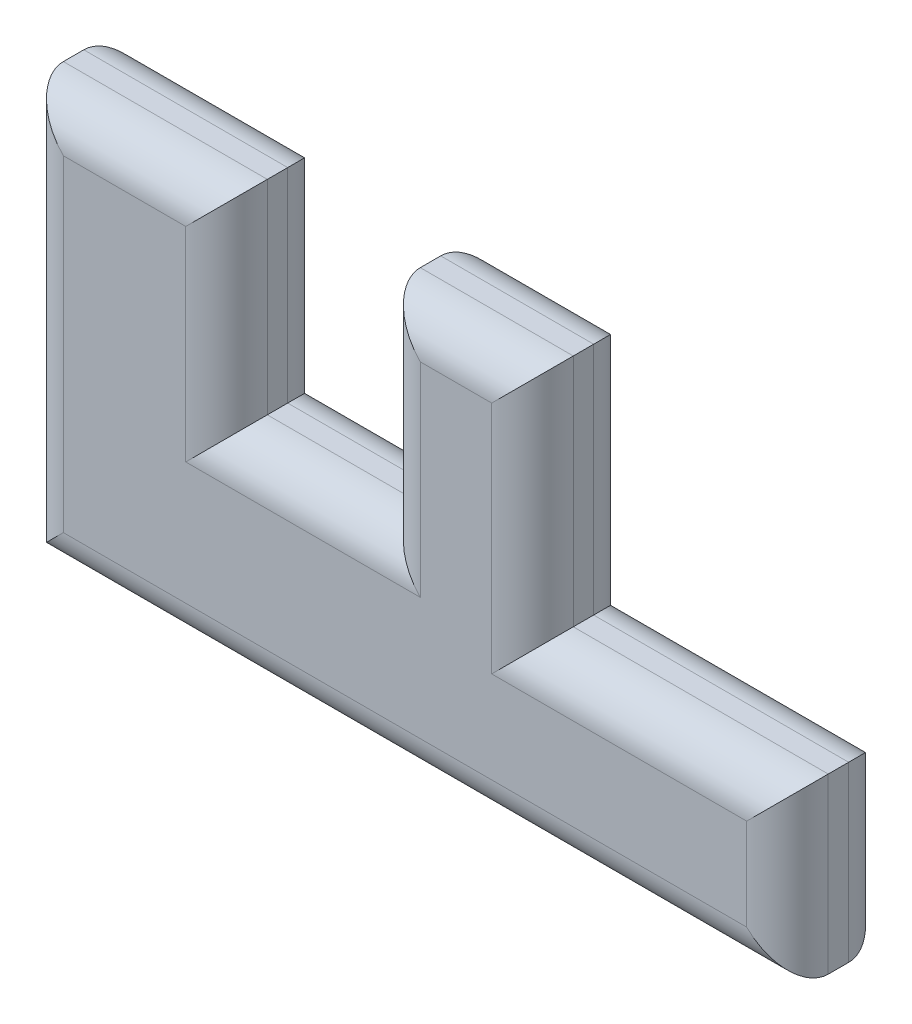
ISO-10303-21;
HEADER;
FILE_DESCRIPTION(('STEP AP214'),'2;1');
FILE_NAME('part.step','',(''),(''),'','','');
FILE_SCHEMA(('AUTOMOTIVE_DESIGN { 1 0 10303 214 1 1 1 1 }'));
ENDSEC;
DATA;
#1=APPLICATION_CONTEXT('core data for automotive mechanical design processes');
#2=APPLICATION_PROTOCOL_DEFINITION('international standard','automotive_design',2000,#1);
#3=PRODUCT_CONTEXT('',#1,'mechanical');
#4=PRODUCT('Part','Part','',(#3));
#5=PRODUCT_RELATED_PRODUCT_CATEGORY('part','',(#4));
#6=PRODUCT_DEFINITION_FORMATION('','',#4);
#7=PRODUCT_DEFINITION_CONTEXT('part definition',#1,'design');
#8=PRODUCT_DEFINITION('design','',#6,#7);
#9=PRODUCT_DEFINITION_SHAPE('','',#8);
#10=(LENGTH_UNIT() NAMED_UNIT(*) SI_UNIT(.MILLI.,.METRE.));
#11=(NAMED_UNIT(*) PLANE_ANGLE_UNIT() SI_UNIT($,.RADIAN.));
#12=(NAMED_UNIT(*) SI_UNIT($,.STERADIAN.) SOLID_ANGLE_UNIT());
#13=UNCERTAINTY_MEASURE_WITH_UNIT(LENGTH_MEASURE(1.E-05),#10,'distance_accuracy_value','');
#14=(GEOMETRIC_REPRESENTATION_CONTEXT(3) GLOBAL_UNCERTAINTY_ASSIGNED_CONTEXT((#13)) GLOBAL_UNIT_ASSIGNED_CONTEXT((#10,
#11,#12)) REPRESENTATION_CONTEXT('',''));
#15=CARTESIAN_POINT('',(0.,0.,0.));
#16=DIRECTION('',(0.,0.,1.));
#17=DIRECTION('',(1.,0.,0.));
#18=AXIS2_PLACEMENT_3D('',#15,#16,#17);
#19=CARTESIAN_POINT('',(95.25,0.,12.7));
#20=DIRECTION('',(0.,1.,0.));
#21=DIRECTION('',(0.,0.,1.));
#22=AXIS2_PLACEMENT_3D('',#19,#20,#21);
#23=PLANE('',#22);
#24=DIRECTION('',(0.,0.,-1.));
#25=VECTOR('',#24,1.);
#26=CARTESIAN_POINT('',(0.,0.,12.7));
#27=LINE('',#26,#25);
#28=CARTESIAN_POINT('',(0.,0.,7.62));
#29=VERTEX_POINT('',#28);
#30=CARTESIAN_POINT('',(0.,0.,5.08));
#31=VERTEX_POINT('',#30);
#32=EDGE_CURVE('E376',#29,#31,#27,.T.);
#33=ORIENTED_EDGE('',*,*,#32,.T.);
#34=DIRECTION('',(1.,0.,0.));
#35=VECTOR('',#34,1.);
#36=CARTESIAN_POINT('',(95.25,0.,5.08));
#37=LINE('',#36,#35);
#38=CARTESIAN_POINT('',(95.25,0.,5.08));
#39=VERTEX_POINT('',#38);
#40=EDGE_CURVE('E311',#31,#39,#37,.T.);
#41=ORIENTED_EDGE('',*,*,#40,.T.);
#42=DIRECTION('',(0.,0.,-1.));
#43=VECTOR('',#42,1.);
#44=CARTESIAN_POINT('',(95.25,0.,12.7));
#45=LINE('',#44,#43);
#46=CARTESIAN_POINT('',(95.25,0.,7.62));
#47=VERTEX_POINT('',#46);
#48=EDGE_CURVE('E208',#47,#39,#45,.T.);
#49=ORIENTED_EDGE('',*,*,#48,.F.);
#50=DIRECTION('',(1.,0.,0.));
#51=VECTOR('',#50,1.);
#52=CARTESIAN_POINT('',(95.25,0.,7.62));
#53=LINE('',#52,#51);
#54=EDGE_CURVE('E308',#47,#29,#53,.F.);
#55=ORIENTED_EDGE('',*,*,#54,.T.);
#56=EDGE_LOOP('',(#33,#41,#49,#55));
#57=FACE_BOUND('',#56,.T.);
#58=ADVANCED_FACE('F45',(#57),#23,.F.);
#59=CARTESIAN_POINT('',(95.25,21.59,12.7));
#60=DIRECTION('',(-1.,0.,0.));
#61=DIRECTION('',(0.,0.,1.));
#62=AXIS2_PLACEMENT_3D('',#59,#60,#61);
#63=PLANE('',#62);
#64=ORIENTED_EDGE('',*,*,#48,.T.);
#65=DIRECTION('',(0.,1.,0.));
#66=VECTOR('',#65,1.);
#67=CARTESIAN_POINT('',(95.25,21.59,5.08));
#68=LINE('',#67,#66);
#69=CARTESIAN_POINT('',(95.25,21.59,5.08));
#70=VERTEX_POINT('',#69);
#71=EDGE_CURVE('E206',#39,#70,#68,.T.);
#72=ORIENTED_EDGE('',*,*,#71,.T.);
#73=DIRECTION('',(0.,0.,-1.));
#74=VECTOR('',#73,1.);
#75=CARTESIAN_POINT('',(95.25,21.59,12.7));
#76=LINE('',#75,#74);
#77=CARTESIAN_POINT('',(95.25,21.59,7.62));
#78=VERTEX_POINT('',#77);
#79=EDGE_CURVE('E187',#78,#70,#76,.T.);
#80=ORIENTED_EDGE('',*,*,#79,.F.);
#81=DIRECTION('',(0.,1.,0.));
#82=VECTOR('',#81,1.);
#83=CARTESIAN_POINT('',(95.25,21.59,7.62));
#84=LINE('',#83,#82);
#85=EDGE_CURVE('E203',#78,#47,#84,.F.);
#86=ORIENTED_EDGE('',*,*,#85,.T.);
#87=EDGE_LOOP('',(#64,#72,#80,#86));
#88=FACE_BOUND('',#87,.T.);
#89=ADVANCED_FACE('F201',(#88),#63,.F.);
#90=CARTESIAN_POINT('',(63.5,21.59,12.7));
#91=DIRECTION('',(0.,-1.,0.));
#92=DIRECTION('',(0.,0.,-1.));
#93=AXIS2_PLACEMENT_3D('',#90,#91,#92);
#94=PLANE('',#93);
#95=ORIENTED_EDGE('',*,*,#79,.T.);
#96=DIRECTION('',(-1.,0.,0.));
#97=VECTOR('',#96,1.);
#98=CARTESIAN_POINT('',(63.5,21.59,5.08));
#99=LINE('',#98,#97);
#100=CARTESIAN_POINT('',(63.5,21.59,5.08));
#101=VERTEX_POINT('',#100);
#102=EDGE_CURVE('E195',#70,#101,#99,.T.);
#103=ORIENTED_EDGE('',*,*,#102,.T.);
#104=DIRECTION('',(0.,0.,-1.));
#105=VECTOR('',#104,1.);
#106=CARTESIAN_POINT('',(63.5,21.59,12.7));
#107=LINE('',#106,#105);
#108=CARTESIAN_POINT('',(63.5,21.59,7.62));
#109=VERTEX_POINT('',#108);
#110=EDGE_CURVE('E189',#109,#101,#107,.T.);
#111=ORIENTED_EDGE('',*,*,#110,.F.);
#112=DIRECTION('',(-1.,0.,0.));
#113=VECTOR('',#112,1.);
#114=CARTESIAN_POINT('',(63.5,21.59,7.62));
#115=LINE('',#114,#113);
#116=EDGE_CURVE('E184',#109,#78,#115,.F.);
#117=ORIENTED_EDGE('',*,*,#116,.T.);
#118=EDGE_LOOP('',(#95,#103,#111,#117));
#119=FACE_BOUND('',#118,.T.);
#120=ADVANCED_FACE('F186',(#119),#94,.F.);
#121=CARTESIAN_POINT('',(63.5,50.8,12.7));
#122=DIRECTION('',(-1.,0.,0.));
#123=DIRECTION('',(0.,0.,1.));
#124=AXIS2_PLACEMENT_3D('',#121,#122,#123);
#125=PLANE('',#124);
#126=ORIENTED_EDGE('',*,*,#110,.T.);
#127=DIRECTION('',(0.,1.,0.));
#128=VECTOR('',#127,1.);
#129=CARTESIAN_POINT('',(63.5,50.8,5.08));
#130=LINE('',#129,#128);
#131=CARTESIAN_POINT('',(63.5,50.8,5.08));
#132=VERTEX_POINT('',#131);
#133=EDGE_CURVE('E268',#101,#132,#130,.T.);
#134=ORIENTED_EDGE('',*,*,#133,.T.);
#135=DIRECTION('',(0.,0.,-1.));
#136=VECTOR('',#135,1.);
#137=CARTESIAN_POINT('',(63.5,50.8,12.7));
#138=LINE('',#137,#136);
#139=CARTESIAN_POINT('',(63.5,50.8,7.62));
#140=VERTEX_POINT('',#139);
#141=EDGE_CURVE('E420',#140,#132,#138,.T.);
#142=ORIENTED_EDGE('',*,*,#141,.F.);
#143=DIRECTION('',(0.,1.,0.));
#144=VECTOR('',#143,1.);
#145=CARTESIAN_POINT('',(63.5,50.8,7.62));
#146=LINE('',#145,#144);
#147=EDGE_CURVE('E265',#140,#109,#146,.F.);
#148=ORIENTED_EDGE('',*,*,#147,.T.);
#149=EDGE_LOOP('',(#126,#134,#142,#148));
#150=FACE_BOUND('',#149,.T.);
#151=ADVANCED_FACE('F425',(#150),#125,.F.);
#152=CARTESIAN_POINT('',(44.45,50.8,12.7));
#153=DIRECTION('',(0.,-1.,0.));
#154=DIRECTION('',(0.,0.,-1.));
#155=AXIS2_PLACEMENT_3D('',#152,#153,#154);
#156=PLANE('',#155);
#157=ORIENTED_EDGE('',*,*,#141,.T.);
#158=DIRECTION('',(-1.,0.,0.));
#159=VECTOR('',#158,1.);
#160=CARTESIAN_POINT('',(44.45,50.8,5.08));
#161=LINE('',#160,#159);
#162=CARTESIAN_POINT('',(44.45,50.8,5.08));
#163=VERTEX_POINT('',#162);
#164=EDGE_CURVE('E274',#132,#163,#161,.T.);
#165=ORIENTED_EDGE('',*,*,#164,.T.);
#166=DIRECTION('',(0.,0.,-1.));
#167=VECTOR('',#166,1.);
#168=CARTESIAN_POINT('',(44.45,50.8,12.7));
#169=LINE('',#168,#167);
#170=CARTESIAN_POINT('',(44.45,50.8,7.62));
#171=VERTEX_POINT('',#170);
#172=EDGE_CURVE('E423',#171,#163,#169,.T.);
#173=ORIENTED_EDGE('',*,*,#172,.F.);
#174=DIRECTION('',(-1.,0.,0.));
#175=VECTOR('',#174,1.);
#176=CARTESIAN_POINT('',(44.45,50.8,7.62));
#177=LINE('',#176,#175);
#178=EDGE_CURVE('E271',#171,#140,#177,.F.);
#179=ORIENTED_EDGE('',*,*,#178,.T.);
#180=EDGE_LOOP('',(#157,#165,#173,#179));
#181=FACE_BOUND('',#180,.T.);
#182=ADVANCED_FACE('F419',(#181),#156,.F.);
#183=CARTESIAN_POINT('',(44.45,25.4,12.7));
#184=DIRECTION('',(1.,0.,0.));
#185=DIRECTION('',(0.,0.,-1.));
#186=AXIS2_PLACEMENT_3D('',#183,#184,#185);
#187=PLANE('',#186);
#188=ORIENTED_EDGE('',*,*,#172,.T.);
#189=DIRECTION('',(0.,-1.,0.));
#190=VECTOR('',#189,1.);
#191=CARTESIAN_POINT('',(44.45,25.4,5.08));
#192=LINE('',#191,#190);
#193=CARTESIAN_POINT('',(44.45,25.4,5.08));
#194=VERTEX_POINT('',#193);
#195=EDGE_CURVE('E280',#163,#194,#192,.T.);
#196=ORIENTED_EDGE('',*,*,#195,.T.);
#197=DIRECTION('',(0.,0.,-1.));
#198=VECTOR('',#197,1.);
#199=CARTESIAN_POINT('',(44.45,25.4,12.7));
#200=LINE('',#199,#198);
#201=CARTESIAN_POINT('',(44.45,25.4,7.62));
#202=VERTEX_POINT('',#201);
#203=EDGE_CURVE('E432',#202,#194,#200,.T.);
#204=ORIENTED_EDGE('',*,*,#203,.F.);
#205=DIRECTION('',(0.,-1.,0.));
#206=VECTOR('',#205,1.);
#207=CARTESIAN_POINT('',(44.45,25.4,7.62));
#208=LINE('',#207,#206);
#209=EDGE_CURVE('E277',#202,#171,#208,.F.);
#210=ORIENTED_EDGE('',*,*,#209,.T.);
#211=EDGE_LOOP('',(#188,#196,#204,#210));
#212=FACE_BOUND('',#211,.T.);
#213=ADVANCED_FACE('F485',(#212),#187,.F.);
#214=CARTESIAN_POINT('',(25.4,25.4,12.7));
#215=DIRECTION('',(0.,-1.,0.));
#216=DIRECTION('',(0.,0.,-1.));
#217=AXIS2_PLACEMENT_3D('',#214,#215,#216);
#218=PLANE('',#217);
#219=ORIENTED_EDGE('',*,*,#203,.T.);
#220=DIRECTION('',(-1.,0.,0.));
#221=VECTOR('',#220,1.);
#222=CARTESIAN_POINT('',(25.4,25.4,5.08));
#223=LINE('',#222,#221);
#224=CARTESIAN_POINT('',(25.4,25.4,5.08));
#225=VERTEX_POINT('',#224);
#226=EDGE_CURVE('E286',#194,#225,#223,.T.);
#227=ORIENTED_EDGE('',*,*,#226,.T.);
#228=DIRECTION('',(0.,0.,-1.));
#229=VECTOR('',#228,1.);
#230=CARTESIAN_POINT('',(25.4,25.4,12.7));
#231=LINE('',#230,#229);
#232=CARTESIAN_POINT('',(25.4,25.4,7.62));
#233=VERTEX_POINT('',#232);
#234=EDGE_CURVE('E438',#233,#225,#231,.T.);
#235=ORIENTED_EDGE('',*,*,#234,.F.);
#236=DIRECTION('',(-1.,0.,0.));
#237=VECTOR('',#236,1.);
#238=CARTESIAN_POINT('',(25.4,25.4,7.62));
#239=LINE('',#238,#237);
#240=EDGE_CURVE('E283',#233,#202,#239,.F.);
#241=ORIENTED_EDGE('',*,*,#240,.T.);
#242=EDGE_LOOP('',(#219,#227,#235,#241));
#243=FACE_BOUND('',#242,.T.);
#244=ADVANCED_FACE('F499',(#243),#218,.F.);
#245=CARTESIAN_POINT('',(25.4,50.8,12.7));
#246=DIRECTION('',(-1.,0.,0.));
#247=DIRECTION('',(0.,-1.,0.));
#248=AXIS2_PLACEMENT_3D('',#245,#246,#247);
#249=PLANE('',#248);
#250=ORIENTED_EDGE('',*,*,#234,.T.);
#251=DIRECTION('',(0.,1.,0.));
#252=VECTOR('',#251,1.);
#253=CARTESIAN_POINT('',(25.4,50.8,5.08));
#254=LINE('',#253,#252);
#255=CARTESIAN_POINT('',(25.4,50.8,5.08));
#256=VERTEX_POINT('',#255);
#257=EDGE_CURVE('E292',#225,#256,#254,.T.);
#258=ORIENTED_EDGE('',*,*,#257,.T.);
#259=DIRECTION('',(0.,0.,-1.));
#260=VECTOR('',#259,1.);
#261=CARTESIAN_POINT('',(25.4,50.8,12.7));
#262=LINE('',#261,#260);
#263=CARTESIAN_POINT('',(25.4,50.8,7.62));
#264=VERTEX_POINT('',#263);
#265=EDGE_CURVE('E442',#264,#256,#262,.T.);
#266=ORIENTED_EDGE('',*,*,#265,.F.);
#267=DIRECTION('',(0.,1.,0.));
#268=VECTOR('',#267,1.);
#269=CARTESIAN_POINT('',(25.4,50.8,7.62));
#270=LINE('',#269,#268);
#271=EDGE_CURVE('E289',#264,#233,#270,.F.);
#272=ORIENTED_EDGE('',*,*,#271,.T.);
#273=EDGE_LOOP('',(#250,#258,#266,#272));
#274=FACE_BOUND('',#273,.T.);
#275=ADVANCED_FACE('F502',(#274),#249,.F.);
#276=CARTESIAN_POINT('',(0.,50.8,12.7));
#277=DIRECTION('',(0.,-1.,0.));
#278=DIRECTION('',(0.,0.,-1.));
#279=AXIS2_PLACEMENT_3D('',#276,#277,#278);
#280=PLANE('',#279);
#281=ORIENTED_EDGE('',*,*,#265,.T.);
#282=DIRECTION('',(-1.,0.,0.));
#283=VECTOR('',#282,1.);
#284=CARTESIAN_POINT('',(0.,50.8,5.08));
#285=LINE('',#284,#283);
#286=CARTESIAN_POINT('',(0.,50.8,5.08));
#287=VERTEX_POINT('',#286);
#288=EDGE_CURVE('E298',#256,#287,#285,.T.);
#289=ORIENTED_EDGE('',*,*,#288,.T.);
#290=DIRECTION('',(0.,0.,-1.));
#291=VECTOR('',#290,1.);
#292=CARTESIAN_POINT('',(0.,50.8,12.7));
#293=LINE('',#292,#291);
#294=CARTESIAN_POINT('',(0.,50.8,7.62));
#295=VERTEX_POINT('',#294);
#296=EDGE_CURVE('E446',#295,#287,#293,.T.);
#297=ORIENTED_EDGE('',*,*,#296,.F.);
#298=DIRECTION('',(-1.,0.,0.));
#299=VECTOR('',#298,1.);
#300=CARTESIAN_POINT('',(0.,50.8,7.62));
#301=LINE('',#300,#299);
#302=EDGE_CURVE('E295',#295,#264,#301,.F.);
#303=ORIENTED_EDGE('',*,*,#302,.T.);
#304=EDGE_LOOP('',(#281,#289,#297,#303));
#305=FACE_BOUND('',#304,.T.);
#306=ADVANCED_FACE('F572',(#305),#280,.F.);
#307=CARTESIAN_POINT('',(0.,0.,12.7));
#308=DIRECTION('',(1.,0.,0.));
#309=DIRECTION('',(0.,0.,-1.));
#310=AXIS2_PLACEMENT_3D('',#307,#308,#309);
#311=PLANE('',#310);
#312=ORIENTED_EDGE('',*,*,#296,.T.);
#313=DIRECTION('',(0.,-1.,0.));
#314=VECTOR('',#313,1.);
#315=CARTESIAN_POINT('',(0.,0.,5.08));
#316=LINE('',#315,#314);
#317=EDGE_CURVE('E305',#287,#31,#316,.T.);
#318=ORIENTED_EDGE('',*,*,#317,.T.);
#319=ORIENTED_EDGE('',*,*,#32,.F.);
#320=DIRECTION('',(0.,-1.,0.));
#321=VECTOR('',#320,1.);
#322=CARTESIAN_POINT('',(0.,0.,7.62));
#323=LINE('',#322,#321);
#324=EDGE_CURVE('E301',#29,#295,#323,.F.);
#325=ORIENTED_EDGE('',*,*,#324,.T.);
#326=EDGE_LOOP('',(#312,#318,#319,#325));
#327=FACE_BOUND('',#326,.T.);
#328=ADVANCED_FACE('F567',(#327),#311,.F.);
#329=CARTESIAN_POINT('',(0.,0.,12.7));
#330=DIRECTION('',(0.,0.,-1.));
#331=DIRECTION('',(-1.,0.,0.));
#332=AXIS2_PLACEMENT_3D('',#329,#330,#331);
#333=PLANE('',#332);
#334=DIRECTION('',(-1.,0.,0.));
#335=VECTOR('',#334,1.);
#336=CARTESIAN_POINT('',(0.,45.72,12.7));
#337=LINE('',#336,#335);
#338=CARTESIAN_POINT('',(20.32,45.72,12.7));
#339=VERTEX_POINT('',#338);
#340=CARTESIAN_POINT('',(5.08,45.72,12.7));
#341=VERTEX_POINT('',#340);
#342=EDGE_CURVE('E55',#339,#341,#337,.T.);
#343=ORIENTED_EDGE('',*,*,#342,.T.);
#344=DIRECTION('',(0.,-1.,0.));
#345=VECTOR('',#344,1.);
#346=CARTESIAN_POINT('',(5.08,0.,12.7));
#347=LINE('',#346,#345);
#348=CARTESIAN_POINT('',(5.08,5.08,12.7));
#349=VERTEX_POINT('',#348);
#350=EDGE_CURVE('E11',#341,#349,#347,.T.);
#351=ORIENTED_EDGE('',*,*,#350,.T.);
#352=DIRECTION('',(1.,0.,0.));
#353=VECTOR('',#352,1.);
#354=CARTESIAN_POINT('',(0.,5.08,12.7));
#355=LINE('',#354,#353);
#356=CARTESIAN_POINT('',(90.17,5.08,12.7));
#357=VERTEX_POINT('',#356);
#358=EDGE_CURVE('E314',#349,#357,#355,.T.);
#359=ORIENTED_EDGE('',*,*,#358,.T.);
#360=DIRECTION('',(0.,1.,0.));
#361=VECTOR('',#360,1.);
#362=CARTESIAN_POINT('',(90.17,0.,12.7));
#363=LINE('',#362,#361);
#364=CARTESIAN_POINT('',(90.17,16.51,12.7));
#365=VERTEX_POINT('',#364);
#366=EDGE_CURVE('E317',#357,#365,#363,.T.);
#367=ORIENTED_EDGE('',*,*,#366,.T.);
#368=DIRECTION('',(-1.,0.,0.));
#369=VECTOR('',#368,1.);
#370=CARTESIAN_POINT('',(0.,16.51,12.7));
#371=LINE('',#370,#369);
#372=CARTESIAN_POINT('',(58.42,16.51,12.7));
#373=VERTEX_POINT('',#372);
#374=EDGE_CURVE('E214',#365,#373,#371,.T.);
#375=ORIENTED_EDGE('',*,*,#374,.T.);
#376=DIRECTION('',(0.,1.,0.));
#377=VECTOR('',#376,1.);
#378=CARTESIAN_POINT('',(58.42,0.,12.7));
#379=LINE('',#378,#377);
#380=CARTESIAN_POINT('',(58.42,45.72,12.7));
#381=VERTEX_POINT('',#380);
#382=EDGE_CURVE('E322',#373,#381,#379,.T.);
#383=ORIENTED_EDGE('',*,*,#382,.T.);
#384=DIRECTION('',(-1.,0.,0.));
#385=VECTOR('',#384,1.);
#386=CARTESIAN_POINT('',(0.,45.72,12.7));
#387=LINE('',#386,#385);
#388=CARTESIAN_POINT('',(49.53,45.72,12.7));
#389=VERTEX_POINT('',#388);
#390=EDGE_CURVE('E325',#381,#389,#387,.T.);
#391=ORIENTED_EDGE('',*,*,#390,.T.);
#392=DIRECTION('',(0.,-1.,0.));
#393=VECTOR('',#392,1.);
#394=CARTESIAN_POINT('',(49.53,0.,12.7));
#395=LINE('',#394,#393);
#396=CARTESIAN_POINT('',(49.53,20.32,12.7));
#397=VERTEX_POINT('',#396);
#398=EDGE_CURVE('E328',#389,#397,#395,.T.);
#399=ORIENTED_EDGE('',*,*,#398,.T.);
#400=DIRECTION('',(-1.,0.,0.));
#401=VECTOR('',#400,1.);
#402=CARTESIAN_POINT('',(0.,20.32,12.7));
#403=LINE('',#402,#401);
#404=CARTESIAN_POINT('',(20.32,20.32,12.7));
#405=VERTEX_POINT('',#404);
#406=EDGE_CURVE('E331',#397,#405,#403,.T.);
#407=ORIENTED_EDGE('',*,*,#406,.T.);
#408=DIRECTION('',(0.,1.,0.));
#409=VECTOR('',#408,1.);
#410=CARTESIAN_POINT('',(20.32,0.,12.7));
#411=LINE('',#410,#409);
#412=EDGE_CURVE('E66',#405,#339,#411,.T.);
#413=ORIENTED_EDGE('',*,*,#412,.T.);
#414=EDGE_LOOP('',(#343,#351,#359,#367,#375,#383,#391,#399,#407,#413));
#415=FACE_BOUND('',#414,.T.);
#416=ADVANCED_FACE('F516',(#415),#333,.F.);
#417=CARTESIAN_POINT('',(0.,0.,0.));
#418=DIRECTION('',(0.,0.,-1.));
#419=DIRECTION('',(-1.,0.,0.));
#420=AXIS2_PLACEMENT_3D('',#417,#418,#419);
#421=PLANE('',#420);
#422=DIRECTION('',(-1.,0.,0.));
#423=VECTOR('',#422,1.);
#424=CARTESIAN_POINT('',(95.25,16.51,0.));
#425=LINE('',#424,#423);
#426=CARTESIAN_POINT('',(58.42,16.51,0.));
#427=VERTEX_POINT('',#426);
#428=CARTESIAN_POINT('',(90.17,16.51,0.));
#429=VERTEX_POINT('',#428);
#430=EDGE_CURVE('E257',#427,#429,#425,.F.);
#431=ORIENTED_EDGE('',*,*,#430,.T.);
#432=DIRECTION('',(0.,1.,0.));
#433=VECTOR('',#432,1.);
#434=CARTESIAN_POINT('',(90.17,0.,0.));
#435=LINE('',#434,#433);
#436=CARTESIAN_POINT('',(90.17,5.08,0.));
#437=VERTEX_POINT('',#436);
#438=EDGE_CURVE('E196',#429,#437,#435,.F.);
#439=ORIENTED_EDGE('',*,*,#438,.T.);
#440=DIRECTION('',(1.,0.,0.));
#441=VECTOR('',#440,1.);
#442=CARTESIAN_POINT('',(0.,5.08,0.));
#443=LINE('',#442,#441);
#444=CARTESIAN_POINT('',(5.08,5.08,0.));
#445=VERTEX_POINT('',#444);
#446=EDGE_CURVE('E230',#437,#445,#443,.F.);
#447=ORIENTED_EDGE('',*,*,#446,.T.);
#448=DIRECTION('',(0.,-1.,0.));
#449=VECTOR('',#448,1.);
#450=CARTESIAN_POINT('',(5.08,50.8,0.));
#451=LINE('',#450,#449);
#452=CARTESIAN_POINT('',(5.08,45.72,0.));
#453=VERTEX_POINT('',#452);
#454=EDGE_CURVE('E236',#445,#453,#451,.F.);
#455=ORIENTED_EDGE('',*,*,#454,.T.);
#456=DIRECTION('',(-1.,0.,0.));
#457=VECTOR('',#456,1.);
#458=CARTESIAN_POINT('',(25.4,45.72,0.));
#459=LINE('',#458,#457);
#460=CARTESIAN_POINT('',(20.32,45.72,0.));
#461=VERTEX_POINT('',#460);
#462=EDGE_CURVE('E239',#453,#461,#459,.F.);
#463=ORIENTED_EDGE('',*,*,#462,.T.);
#464=DIRECTION('',(0.,1.,0.));
#465=VECTOR('',#464,1.);
#466=CARTESIAN_POINT('',(20.32,25.4,0.));
#467=LINE('',#466,#465);
#468=CARTESIAN_POINT('',(20.32,20.32,0.));
#469=VERTEX_POINT('',#468);
#470=EDGE_CURVE('E242',#461,#469,#467,.F.);
#471=ORIENTED_EDGE('',*,*,#470,.T.);
#472=DIRECTION('',(-1.,0.,0.));
#473=VECTOR('',#472,1.);
#474=CARTESIAN_POINT('',(44.45,20.32,0.));
#475=LINE('',#474,#473);
#476=CARTESIAN_POINT('',(49.53,20.32,0.));
#477=VERTEX_POINT('',#476);
#478=EDGE_CURVE('E245',#469,#477,#475,.F.);
#479=ORIENTED_EDGE('',*,*,#478,.T.);
#480=DIRECTION('',(0.,-1.,0.));
#481=VECTOR('',#480,1.);
#482=CARTESIAN_POINT('',(49.53,50.8,0.));
#483=LINE('',#482,#481);
#484=CARTESIAN_POINT('',(49.53,45.72,0.));
#485=VERTEX_POINT('',#484);
#486=EDGE_CURVE('E248',#477,#485,#483,.F.);
#487=ORIENTED_EDGE('',*,*,#486,.T.);
#488=DIRECTION('',(-1.,0.,0.));
#489=VECTOR('',#488,1.);
#490=CARTESIAN_POINT('',(63.5,45.72,0.));
#491=LINE('',#490,#489);
#492=CARTESIAN_POINT('',(58.42,45.72,0.));
#493=VERTEX_POINT('',#492);
#494=EDGE_CURVE('E251',#485,#493,#491,.F.);
#495=ORIENTED_EDGE('',*,*,#494,.T.);
#496=DIRECTION('',(0.,1.,0.));
#497=VECTOR('',#496,1.);
#498=CARTESIAN_POINT('',(58.42,21.59,0.));
#499=LINE('',#498,#497);
#500=EDGE_CURVE('E254',#493,#427,#499,.F.);
#501=ORIENTED_EDGE('',*,*,#500,.T.);
#502=EDGE_LOOP('',(#431,#439,#447,#455,#463,#471,#479,#487,#495,#501));
#503=FACE_BOUND('',#502,.T.);
#504=ADVANCED_FACE('F558',(#503),#421,.T.);
#505=CARTESIAN_POINT('',(25.4,20.32,5.08));
#506=DIRECTION('',(1.,0.,0.));
#507=DIRECTION('',(0.,0.,-1.));
#508=AXIS2_PLACEMENT_3D('',#505,#506,#507);
#509=CYLINDRICAL_SURFACE('',#508,5.08);
#510=CARTESIAN_POINT('',(49.53,20.32,5.08));
#511=DIRECTION('',(0.707106781186547,0.707106781186547,0.));
#512=DIRECTION('',(-0.707106781186547,0.707106781186547,0.));
#513=AXIS2_PLACEMENT_3D('',#510,#511,#512);
#514=ELLIPSE('',#513,7.18420489685532,5.08);
#515=EDGE_CURVE('E368',#477,#194,#514,.T.);
#516=ORIENTED_EDGE('',*,*,#515,.F.);
#517=ORIENTED_EDGE('',*,*,#478,.F.);
#518=CARTESIAN_POINT('',(20.32,20.32,5.08));
#519=DIRECTION('',(0.707106781186548,-0.707106781186547,0.));
#520=DIRECTION('',(0.707106781186547,0.707106781186548,0.));
#521=AXIS2_PLACEMENT_3D('',#518,#519,#520);
#522=ELLIPSE('',#521,7.18420489685532,5.08);
#523=EDGE_CURVE('E372',#225,#469,#522,.F.);
#524=ORIENTED_EDGE('',*,*,#523,.F.);
#525=ORIENTED_EDGE('',*,*,#226,.F.);
#526=EDGE_LOOP('',(#516,#517,#524,#525));
#527=FACE_BOUND('',#526,.T.);
#528=ADVANCED_FACE('F494',(#527),#509,.T.);
#529=CARTESIAN_POINT('',(20.32,50.8,5.08));
#530=DIRECTION('',(0.,-1.,0.));
#531=DIRECTION('',(1.,0.,0.));
#532=AXIS2_PLACEMENT_3D('',#529,#530,#531);
#533=CYLINDRICAL_SURFACE('',#532,5.08);
#534=ORIENTED_EDGE('',*,*,#523,.T.);
#535=ORIENTED_EDGE('',*,*,#470,.F.);
#536=CARTESIAN_POINT('',(20.32,45.72,5.08));
#537=DIRECTION('',(0.707106781186548,-0.707106781186547,0.));
#538=DIRECTION('',(0.707106781186547,0.707106781186548,0.));
#539=AXIS2_PLACEMENT_3D('',#536,#537,#538);
#540=ELLIPSE('',#539,7.18420489685532,5.08);
#541=EDGE_CURVE('E364',#256,#461,#540,.F.);
#542=ORIENTED_EDGE('',*,*,#541,.F.);
#543=ORIENTED_EDGE('',*,*,#257,.F.);
#544=EDGE_LOOP('',(#534,#535,#542,#543));
#545=FACE_BOUND('',#544,.T.);
#546=ADVANCED_FACE('F553',(#545),#533,.T.);
#547=CARTESIAN_POINT('',(49.53,25.4,5.08));
#548=DIRECTION('',(0.,1.,0.));
#549=DIRECTION('',(0.,0.,1.));
#550=AXIS2_PLACEMENT_3D('',#547,#548,#549);
#551=CYLINDRICAL_SURFACE('',#550,5.08);
#552=ORIENTED_EDGE('',*,*,#515,.T.);
#553=ORIENTED_EDGE('',*,*,#195,.F.);
#554=CARTESIAN_POINT('',(49.53,45.72,5.08));
#555=DIRECTION('',(0.707106781186547,0.707106781186547,0.));
#556=DIRECTION('',(-0.707106781186547,0.707106781186547,0.));
#557=AXIS2_PLACEMENT_3D('',#554,#555,#556);
#558=ELLIPSE('',#557,7.18420489685532,5.08);
#559=EDGE_CURVE('E360',#485,#163,#558,.T.);
#560=ORIENTED_EDGE('',*,*,#559,.F.);
#561=ORIENTED_EDGE('',*,*,#486,.F.);
#562=EDGE_LOOP('',(#552,#553,#560,#561));
#563=FACE_BOUND('',#562,.T.);
#564=ADVANCED_FACE('F488',(#563),#551,.T.);
#565=CARTESIAN_POINT('',(0.,45.72,5.08));
#566=DIRECTION('',(1.,0.,0.));
#567=DIRECTION('',(0.,0.,-1.));
#568=AXIS2_PLACEMENT_3D('',#565,#566,#567);
#569=CYLINDRICAL_SURFACE('',#568,5.08);
#570=ORIENTED_EDGE('',*,*,#541,.T.);
#571=ORIENTED_EDGE('',*,*,#462,.F.);
#572=CARTESIAN_POINT('',(5.08,45.72,5.08));
#573=DIRECTION('',(0.707106781186547,0.707106781186547,0.));
#574=DIRECTION('',(-0.707106781186547,0.707106781186547,0.));
#575=AXIS2_PLACEMENT_3D('',#572,#573,#574);
#576=ELLIPSE('',#575,7.18420489685532,5.08);
#577=EDGE_CURVE('E356',#287,#453,#576,.F.);
#578=ORIENTED_EDGE('',*,*,#577,.F.);
#579=ORIENTED_EDGE('',*,*,#288,.F.);
#580=EDGE_LOOP('',(#570,#571,#578,#579));
#581=FACE_BOUND('',#580,.T.);
#582=ADVANCED_FACE('F547',(#581),#569,.T.);
#583=CARTESIAN_POINT('',(44.45,45.72,5.08));
#584=DIRECTION('',(1.,0.,0.));
#585=DIRECTION('',(0.,0.,-1.));
#586=AXIS2_PLACEMENT_3D('',#583,#584,#585);
#587=CYLINDRICAL_SURFACE('',#586,5.08);
#588=ORIENTED_EDGE('',*,*,#559,.T.);
#589=ORIENTED_EDGE('',*,*,#164,.F.);
#590=CARTESIAN_POINT('',(58.42,45.72,5.08));
#591=DIRECTION('',(0.707106781186547,-0.707106781186547,0.));
#592=DIRECTION('',(0.707106781186547,0.707106781186547,0.));
#593=AXIS2_PLACEMENT_3D('',#590,#591,#592);
#594=ELLIPSE('',#593,7.18420489685532,5.08);
#595=EDGE_CURVE('E352',#493,#132,#594,.T.);
#596=ORIENTED_EDGE('',*,*,#595,.F.);
#597=ORIENTED_EDGE('',*,*,#494,.F.);
#598=EDGE_LOOP('',(#588,#589,#596,#597));
#599=FACE_BOUND('',#598,.T.);
#600=ADVANCED_FACE('F481',(#599),#587,.T.);
#601=CARTESIAN_POINT('',(5.08,0.,5.08));
#602=DIRECTION('',(0.,1.,0.));
#603=DIRECTION('',(0.,0.,1.));
#604=AXIS2_PLACEMENT_3D('',#601,#602,#603);
#605=CYLINDRICAL_SURFACE('',#604,5.08);
#606=ORIENTED_EDGE('',*,*,#577,.T.);
#607=ORIENTED_EDGE('',*,*,#454,.F.);
#608=CARTESIAN_POINT('',(5.08,5.08,5.08));
#609=DIRECTION('',(-0.707106781186547,0.707106781186547,0.));
#610=DIRECTION('',(-0.707106781186547,-0.707106781186547,0.));
#611=AXIS2_PLACEMENT_3D('',#608,#609,#610);
#612=ELLIPSE('',#611,7.18420489685532,5.08);
#613=EDGE_CURVE('E348',#31,#445,#612,.F.);
#614=ORIENTED_EDGE('',*,*,#613,.F.);
#615=ORIENTED_EDGE('',*,*,#317,.F.);
#616=EDGE_LOOP('',(#606,#607,#614,#615));
#617=FACE_BOUND('',#616,.T.);
#618=ADVANCED_FACE('F461',(#617),#605,.T.);
#619=CARTESIAN_POINT('',(58.42,50.8,5.08));
#620=DIRECTION('',(0.,-1.,0.));
#621=DIRECTION('',(0.,0.,-1.));
#622=AXIS2_PLACEMENT_3D('',#619,#620,#621);
#623=CYLINDRICAL_SURFACE('',#622,5.08);
#624=ORIENTED_EDGE('',*,*,#595,.T.);
#625=ORIENTED_EDGE('',*,*,#133,.F.);
#626=CARTESIAN_POINT('',(58.42,16.51,5.08));
#627=DIRECTION('',(0.707106781186547,-0.707106781186547,0.));
#628=DIRECTION('',(0.707106781186547,0.707106781186547,0.));
#629=AXIS2_PLACEMENT_3D('',#626,#627,#628);
#630=ELLIPSE('',#629,7.18420489685532,5.08);
#631=EDGE_CURVE('E344',#427,#101,#630,.T.);
#632=ORIENTED_EDGE('',*,*,#631,.F.);
#633=ORIENTED_EDGE('',*,*,#500,.F.);
#634=EDGE_LOOP('',(#624,#625,#632,#633));
#635=FACE_BOUND('',#634,.T.);
#636=ADVANCED_FACE('F476',(#635),#623,.T.);
#637=CARTESIAN_POINT('',(95.25,5.08,5.08));
#638=DIRECTION('',(-1.,0.,0.));
#639=DIRECTION('',(0.,0.,1.));
#640=AXIS2_PLACEMENT_3D('',#637,#638,#639);
#641=CYLINDRICAL_SURFACE('',#640,5.08);
#642=ORIENTED_EDGE('',*,*,#613,.T.);
#643=ORIENTED_EDGE('',*,*,#446,.F.);
#644=CARTESIAN_POINT('',(90.17,5.08,5.08));
#645=DIRECTION('',(-0.707106781186547,-0.707106781186547,0.));
#646=DIRECTION('',(-0.707106781186547,0.707106781186547,0.));
#647=AXIS2_PLACEMENT_3D('',#644,#645,#646);
#648=ELLIPSE('',#647,7.18420489685532,5.08);
#649=EDGE_CURVE('E341',#39,#437,#648,.F.);
#650=ORIENTED_EDGE('',*,*,#649,.F.);
#651=ORIENTED_EDGE('',*,*,#40,.F.);
#652=EDGE_LOOP('',(#642,#643,#650,#651));
#653=FACE_BOUND('',#652,.T.);
#654=ADVANCED_FACE('F465',(#653),#641,.T.);
#655=CARTESIAN_POINT('',(63.5,16.51,5.08));
#656=DIRECTION('',(1.,0.,0.));
#657=DIRECTION('',(0.,0.,-1.));
#658=AXIS2_PLACEMENT_3D('',#655,#656,#657);
#659=CYLINDRICAL_SURFACE('',#658,5.08);
#660=ORIENTED_EDGE('',*,*,#631,.T.);
#661=ORIENTED_EDGE('',*,*,#102,.F.);
#662=CARTESIAN_POINT('',(90.17,16.51,5.08));
#663=DIRECTION('',(0.707106781186547,-0.707106781186547,0.));
#664=DIRECTION('',(0.707106781186547,0.707106781186547,0.));
#665=AXIS2_PLACEMENT_3D('',#662,#663,#664);
#666=ELLIPSE('',#665,7.18420489685532,5.08);
#667=EDGE_CURVE('E338',#429,#70,#666,.T.);
#668=ORIENTED_EDGE('',*,*,#667,.F.);
#669=ORIENTED_EDGE('',*,*,#430,.F.);
#670=EDGE_LOOP('',(#660,#661,#668,#669));
#671=FACE_BOUND('',#670,.T.);
#672=ADVANCED_FACE('F473',(#671),#659,.T.);
#673=CARTESIAN_POINT('',(90.17,21.59,5.08));
#674=DIRECTION('',(0.,-1.,0.));
#675=DIRECTION('',(0.,0.,-1.));
#676=AXIS2_PLACEMENT_3D('',#673,#674,#675);
#677=CYLINDRICAL_SURFACE('',#676,5.08);
#678=ORIENTED_EDGE('',*,*,#649,.T.);
#679=ORIENTED_EDGE('',*,*,#438,.F.);
#680=ORIENTED_EDGE('',*,*,#667,.T.);
#681=ORIENTED_EDGE('',*,*,#71,.F.);
#682=EDGE_LOOP('',(#678,#679,#680,#681));
#683=FACE_BOUND('',#682,.T.);
#684=ADVANCED_FACE('F468',(#683),#677,.T.);
#685=CARTESIAN_POINT('',(0.,45.72,7.62));
#686=DIRECTION('',(-1.,0.,0.));
#687=DIRECTION('',(0.,0.,1.));
#688=AXIS2_PLACEMENT_3D('',#685,#686,#687);
#689=CYLINDRICAL_SURFACE('',#688,5.08);
#690=CARTESIAN_POINT('',(58.42,45.72,7.62));
#691=DIRECTION('',(-0.707106781186547,0.707106781186547,0.));
#692=DIRECTION('',(0.707106781186547,0.707106781186547,0.));
#693=AXIS2_PLACEMENT_3D('',#690,#691,#692);
#694=ELLIPSE('',#693,7.18420489685532,5.08);
#695=EDGE_CURVE('E397',#140,#381,#694,.F.);
#696=ORIENTED_EDGE('',*,*,#695,.F.);
#697=ORIENTED_EDGE('',*,*,#178,.F.);
#698=CARTESIAN_POINT('',(49.53,45.72,7.62));
#699=DIRECTION('',(-0.707106781186547,-0.707106781186547,0.));
#700=DIRECTION('',(-0.707106781186547,0.707106781186547,0.));
#701=AXIS2_PLACEMENT_3D('',#698,#699,#700);
#702=ELLIPSE('',#701,7.18420489685532,5.08);
#703=EDGE_CURVE('E49',#389,#171,#702,.T.);
#704=ORIENTED_EDGE('',*,*,#703,.F.);
#705=ORIENTED_EDGE('',*,*,#390,.F.);
#706=EDGE_LOOP('',(#696,#697,#704,#705));
#707=FACE_BOUND('',#706,.T.);
#708=ADVANCED_FACE('F47',(#707),#689,.T.);
#709=CARTESIAN_POINT('',(49.53,0.,7.62));
#710=DIRECTION('',(0.,-1.,0.));
#711=DIRECTION('',(0.,0.,-1.));
#712=AXIS2_PLACEMENT_3D('',#709,#710,#711);
#713=CYLINDRICAL_SURFACE('',#712,5.08);
#714=ORIENTED_EDGE('',*,*,#703,.T.);
#715=ORIENTED_EDGE('',*,*,#209,.F.);
#716=CARTESIAN_POINT('',(49.53,20.32,7.62));
#717=DIRECTION('',(-0.707106781186547,-0.707106781186547,0.));
#718=DIRECTION('',(-0.707106781186547,0.707106781186547,0.));
#719=AXIS2_PLACEMENT_3D('',#716,#717,#718);
#720=ELLIPSE('',#719,7.18420489685532,5.08);
#721=EDGE_CURVE('E394',#397,#202,#720,.T.);
#722=ORIENTED_EDGE('',*,*,#721,.F.);
#723=ORIENTED_EDGE('',*,*,#398,.F.);
#724=EDGE_LOOP('',(#714,#715,#722,#723));
#725=FACE_BOUND('',#724,.T.);
#726=ADVANCED_FACE('F410',(#725),#713,.T.);
#727=CARTESIAN_POINT('',(58.42,0.,7.62));
#728=DIRECTION('',(0.,1.,0.));
#729=DIRECTION('',(0.,0.,1.));
#730=AXIS2_PLACEMENT_3D('',#727,#728,#729);
#731=CYLINDRICAL_SURFACE('',#730,5.08);
#732=ORIENTED_EDGE('',*,*,#695,.T.);
#733=ORIENTED_EDGE('',*,*,#382,.F.);
#734=CARTESIAN_POINT('',(58.42,16.51,7.62));
#735=DIRECTION('',(-0.707106781186547,0.707106781186547,0.));
#736=DIRECTION('',(0.707106781186547,0.707106781186547,0.));
#737=AXIS2_PLACEMENT_3D('',#734,#735,#736);
#738=ELLIPSE('',#737,7.18420489685532,5.08);
#739=EDGE_CURVE('E391',#109,#373,#738,.F.);
#740=ORIENTED_EDGE('',*,*,#739,.F.);
#741=ORIENTED_EDGE('',*,*,#147,.F.);
#742=EDGE_LOOP('',(#732,#733,#740,#741));
#743=FACE_BOUND('',#742,.T.);
#744=ADVANCED_FACE('F709',(#743),#731,.T.);
#745=CARTESIAN_POINT('',(0.,20.32,7.62));
#746=DIRECTION('',(-1.,0.,0.));
#747=DIRECTION('',(0.,0.,1.));
#748=AXIS2_PLACEMENT_3D('',#745,#746,#747);
#749=CYLINDRICAL_SURFACE('',#748,5.08);
#750=ORIENTED_EDGE('',*,*,#721,.T.);
#751=ORIENTED_EDGE('',*,*,#240,.F.);
#752=CARTESIAN_POINT('',(20.32,20.32,7.62));
#753=DIRECTION('',(-0.707106781186548,0.707106781186547,0.));
#754=DIRECTION('',(0.707106781186547,0.707106781186548,0.));
#755=AXIS2_PLACEMENT_3D('',#752,#753,#754);
#756=ELLIPSE('',#755,7.18420489685532,5.08);
#757=EDGE_CURVE('E218',#405,#233,#756,.T.);
#758=ORIENTED_EDGE('',*,*,#757,.F.);
#759=ORIENTED_EDGE('',*,*,#406,.F.);
#760=EDGE_LOOP('',(#750,#751,#758,#759));
#761=FACE_BOUND('',#760,.T.);
#762=ADVANCED_FACE('F717',(#761),#749,.T.);
#763=CARTESIAN_POINT('',(0.,16.51,7.62));
#764=DIRECTION('',(-1.,0.,0.));
#765=DIRECTION('',(0.,0.,1.));
#766=AXIS2_PLACEMENT_3D('',#763,#764,#765);
#767=CYLINDRICAL_SURFACE('',#766,5.08);
#768=ORIENTED_EDGE('',*,*,#739,.T.);
#769=ORIENTED_EDGE('',*,*,#374,.F.);
#770=CARTESIAN_POINT('',(90.17,16.51,7.62));
#771=DIRECTION('',(-0.707106781186547,0.707106781186547,0.));
#772=DIRECTION('',(0.707106781186547,0.707106781186547,0.));
#773=AXIS2_PLACEMENT_3D('',#770,#771,#772);
#774=ELLIPSE('',#773,7.18420489685532,5.08);
#775=EDGE_CURVE('E212',#78,#365,#774,.F.);
#776=ORIENTED_EDGE('',*,*,#775,.F.);
#777=ORIENTED_EDGE('',*,*,#116,.F.);
#778=EDGE_LOOP('',(#768,#769,#776,#777));
#779=FACE_BOUND('',#778,.T.);
#780=ADVANCED_FACE('F213',(#779),#767,.T.);
#781=CARTESIAN_POINT('',(20.32,0.,7.62));
#782=DIRECTION('',(0.,1.,0.));
#783=DIRECTION('',(-1.,0.,0.));
#784=AXIS2_PLACEMENT_3D('',#781,#782,#783);
#785=CYLINDRICAL_SURFACE('',#784,5.08);
#786=ORIENTED_EDGE('',*,*,#757,.T.);
#787=ORIENTED_EDGE('',*,*,#271,.F.);
#788=CARTESIAN_POINT('',(20.32,45.72,7.62));
#789=DIRECTION('',(-0.707106781186548,0.707106781186547,0.));
#790=DIRECTION('',(0.707106781186547,0.707106781186548,0.));
#791=AXIS2_PLACEMENT_3D('',#788,#789,#790);
#792=ELLIPSE('',#791,7.18420489685532,5.08);
#793=EDGE_CURVE('E219',#339,#264,#792,.T.);
#794=ORIENTED_EDGE('',*,*,#793,.F.);
#795=ORIENTED_EDGE('',*,*,#412,.F.);
#796=EDGE_LOOP('',(#786,#787,#794,#795));
#797=FACE_BOUND('',#796,.T.);
#798=ADVANCED_FACE('F506',(#797),#785,.T.);
#799=CARTESIAN_POINT('',(90.17,0.,7.62));
#800=DIRECTION('',(0.,1.,0.));
#801=DIRECTION('',(0.,0.,1.));
#802=AXIS2_PLACEMENT_3D('',#799,#800,#801);
#803=CYLINDRICAL_SURFACE('',#802,5.08);
#804=ORIENTED_EDGE('',*,*,#775,.T.);
#805=ORIENTED_EDGE('',*,*,#366,.F.);
#806=CARTESIAN_POINT('',(90.17,5.08,7.62));
#807=DIRECTION('',(0.707106781186547,0.707106781186547,0.));
#808=DIRECTION('',(0.707106781186547,-0.707106781186547,0.));
#809=AXIS2_PLACEMENT_3D('',#806,#807,#808);
#810=ELLIPSE('',#809,7.18420489685532,5.08);
#811=EDGE_CURVE('E224',#47,#357,#810,.F.);
#812=ORIENTED_EDGE('',*,*,#811,.F.);
#813=ORIENTED_EDGE('',*,*,#85,.F.);
#814=EDGE_LOOP('',(#804,#805,#812,#813));
#815=FACE_BOUND('',#814,.T.);
#816=ADVANCED_FACE('F222',(#815),#803,.T.);
#817=CARTESIAN_POINT('',(0.,45.72,7.62));
#818=DIRECTION('',(-1.,0.,0.));
#819=DIRECTION('',(0.,0.,1.));
#820=AXIS2_PLACEMENT_3D('',#817,#818,#819);
#821=CYLINDRICAL_SURFACE('',#820,5.08);
#822=ORIENTED_EDGE('',*,*,#793,.T.);
#823=ORIENTED_EDGE('',*,*,#302,.F.);
#824=CARTESIAN_POINT('',(5.08,45.72,7.62));
#825=DIRECTION('',(-0.707106781186547,-0.707106781186547,0.));
#826=DIRECTION('',(-0.707106781186547,0.707106781186547,0.));
#827=AXIS2_PLACEMENT_3D('',#824,#825,#826);
#828=ELLIPSE('',#827,7.18420489685532,5.08);
#829=EDGE_CURVE('E380',#341,#295,#828,.T.);
#830=ORIENTED_EDGE('',*,*,#829,.F.);
#831=ORIENTED_EDGE('',*,*,#342,.F.);
#832=EDGE_LOOP('',(#822,#823,#830,#831));
#833=FACE_BOUND('',#832,.T.);
#834=ADVANCED_FACE('F510',(#833),#821,.T.);
#835=CARTESIAN_POINT('',(0.,5.08,7.62));
#836=DIRECTION('',(1.,0.,0.));
#837=DIRECTION('',(0.,0.,-1.));
#838=AXIS2_PLACEMENT_3D('',#835,#836,#837);
#839=CYLINDRICAL_SURFACE('',#838,5.08);
#840=ORIENTED_EDGE('',*,*,#811,.T.);
#841=ORIENTED_EDGE('',*,*,#358,.F.);
#842=CARTESIAN_POINT('',(5.08,5.08,7.62));
#843=DIRECTION('',(0.707106781186547,-0.707106781186547,0.));
#844=DIRECTION('',(0.707106781186547,0.707106781186547,0.));
#845=AXIS2_PLACEMENT_3D('',#842,#843,#844);
#846=ELLIPSE('',#845,7.18420489685532,5.08);
#847=EDGE_CURVE('E377',#29,#349,#846,.F.);
#848=ORIENTED_EDGE('',*,*,#847,.F.);
#849=ORIENTED_EDGE('',*,*,#54,.F.);
#850=EDGE_LOOP('',(#840,#841,#848,#849));
#851=FACE_BOUND('',#850,.T.);
#852=ADVANCED_FACE('F518',(#851),#839,.T.);
#853=CARTESIAN_POINT('',(5.08,0.,7.62));
#854=DIRECTION('',(0.,-1.,0.));
#855=DIRECTION('',(0.,0.,-1.));
#856=AXIS2_PLACEMENT_3D('',#853,#854,#855);
#857=CYLINDRICAL_SURFACE('',#856,5.08);
#858=ORIENTED_EDGE('',*,*,#829,.T.);
#859=ORIENTED_EDGE('',*,*,#324,.F.);
#860=ORIENTED_EDGE('',*,*,#847,.T.);
#861=ORIENTED_EDGE('',*,*,#350,.F.);
#862=EDGE_LOOP('',(#858,#859,#860,#861));
#863=FACE_BOUND('',#862,.T.);
#864=ADVANCED_FACE('F513',(#863),#857,.T.);
#865=CLOSED_SHELL('',(#58,#89,#120,#151,#182,#213,#244,#275,#306,#328,#416,#504,#528,#546,#564,
#582,#600,#618,#636,#654,#672,#684,#708,#726,#744,#762,#780,#798,#816,#834,#852,#864));
#866=MANIFOLD_SOLID_BREP('B2',#865);
#867=ADVANCED_BREP_SHAPE_REPRESENTATION('',(#18,#866),#14);
#868=SHAPE_DEFINITION_REPRESENTATION(#9,#867);
ENDSEC;
END-ISO-10303-21;
